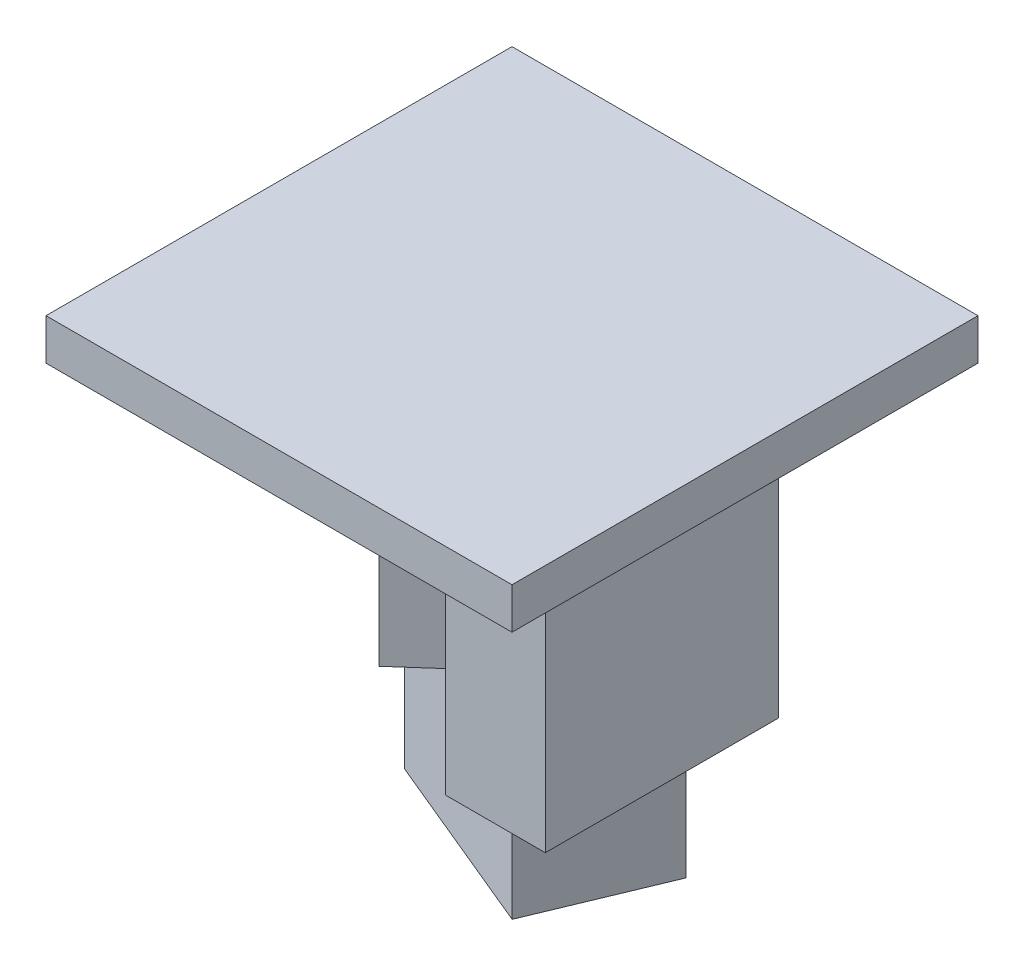
ISO-10303-21;
HEADER;
FILE_DESCRIPTION(('STEP AP214'),'2;1');
FILE_NAME('part.step','',(''),(''),'','','');
FILE_SCHEMA(('AUTOMOTIVE_DESIGN { 1 0 10303 214 1 1 1 1 }'));
ENDSEC;
DATA;
#1=APPLICATION_CONTEXT('core data for automotive mechanical design processes');
#2=APPLICATION_PROTOCOL_DEFINITION('international standard','automotive_design',2000,#1);
#3=PRODUCT_CONTEXT('',#1,'mechanical');
#4=PRODUCT('Part','Part','',(#3));
#5=PRODUCT_RELATED_PRODUCT_CATEGORY('part','',(#4));
#6=PRODUCT_DEFINITION_FORMATION('','',#4);
#7=PRODUCT_DEFINITION_CONTEXT('part definition',#1,'design');
#8=PRODUCT_DEFINITION('design','',#6,#7);
#9=PRODUCT_DEFINITION_SHAPE('','',#8);
#10=(LENGTH_UNIT() NAMED_UNIT(*) SI_UNIT(.MILLI.,.METRE.));
#11=(NAMED_UNIT(*) PLANE_ANGLE_UNIT() SI_UNIT($,.RADIAN.));
#12=(NAMED_UNIT(*) SI_UNIT($,.STERADIAN.) SOLID_ANGLE_UNIT());
#13=UNCERTAINTY_MEASURE_WITH_UNIT(LENGTH_MEASURE(1.E-05),#10,'distance_accuracy_value','');
#14=(GEOMETRIC_REPRESENTATION_CONTEXT(3) GLOBAL_UNCERTAINTY_ASSIGNED_CONTEXT((#13)) GLOBAL_UNIT_ASSIGNED_CONTEXT((#10,
#11,#12)) REPRESENTATION_CONTEXT('',''));
#15=CARTESIAN_POINT('',(0.,0.,0.));
#16=DIRECTION('',(0.,0.,1.));
#17=DIRECTION('',(1.,0.,0.));
#18=AXIS2_PLACEMENT_3D('',#15,#16,#17);
#19=CARTESIAN_POINT('',(0.,-107.6,0.));
#20=DIRECTION('',(0.,1.,0.));
#21=DIRECTION('',(0.,0.,1.));
#22=AXIS2_PLACEMENT_3D('',#19,#20,#21);
#23=PLANE('',#22);
#24=DIRECTION('',(0.383702240357465,0.,-0.923456869997003));
#25=VECTOR('',#24,1.);
#26=CARTESIAN_POINT('',(-44.9674134937716,-107.6,-3.88839100415224));
#27=LINE('',#26,#25);
#28=CARTESIAN_POINT('',(-44.9674134937716,-107.6,-3.88839100415224));
#29=VERTEX_POINT('',#28);
#30=CARTESIAN_POINT('',(-25.4753396836124,-107.6,-50.8));
#31=VERTEX_POINT('',#30);
#32=EDGE_CURVE('E186',#29,#31,#27,.T.);
#33=ORIENTED_EDGE('',*,*,#32,.F.);
#34=DIRECTION('',(-0.923456869997003,0.,-0.383702240357465));
#35=VECTOR('',#34,1.);
#36=CARTESIAN_POINT('',(25.4,-107.6,25.3497197110866));
#37=LINE('',#36,#35);
#38=CARTESIAN_POINT('',(-15.5961921600757,-107.6,8.31553945966104));
#39=VERTEX_POINT('',#38);
#40=EDGE_CURVE('E61',#39,#29,#37,.T.);
#41=ORIENTED_EDGE('',*,*,#40,.F.);
#42=DIRECTION('',(-0.748516935361959,0.,0.663115674280393));
#43=VECTOR('',#42,1.);
#44=CARTESIAN_POINT('',(-29.813723746556,-107.6,20.9109365698315));
#45=LINE('',#44,#43);
#46=CARTESIAN_POINT('',(-29.813723746556,-107.6,20.9109365698315));
#47=VERTEX_POINT('',#46);
#48=EDGE_CURVE('E247',#39,#47,#45,.T.);
#49=ORIENTED_EDGE('',*,*,#48,.T.);
#50=DIRECTION('',(-0.663115674280393,0.,-0.748516935361959));
#51=VECTOR('',#50,1.);
#52=CARTESIAN_POINT('',(-63.5,-107.6,-17.113723746556));
#53=LINE('',#52,#51);
#54=CARTESIAN_POINT('',(-63.5,-107.6,-17.113723746556));
#55=VERTEX_POINT('',#54);
#56=EDGE_CURVE('E253',#47,#55,#53,.T.);
#57=ORIENTED_EDGE('',*,*,#56,.T.);
#58=DIRECTION('',(0.748516935361959,0.,-0.663115674280393));
#59=VECTOR('',#58,1.);
#60=CARTESIAN_POINT('',(-25.4753396836124,-107.6,-50.8));
#61=LINE('',#60,#59);
#62=EDGE_CURVE('E256',#55,#31,#61,.T.);
#63=ORIENTED_EDGE('',*,*,#62,.T.);
#64=EDGE_LOOP('',(#33,#41,#49,#57,#63));
#65=FACE_BOUND('',#64,.T.);
#66=ADVANCED_FACE('F43',(#65),#23,.F.);
#67=CARTESIAN_POINT('',(0.,-3.,0.));
#68=DIRECTION('',(0.,1.,0.));
#69=DIRECTION('',(0.,0.,1.));
#70=AXIS2_PLACEMENT_3D('',#67,#68,#69);
#71=PLANE('',#70);
#72=DIRECTION('',(0.663115674280393,0.,0.748516935361959));
#73=VECTOR('',#72,1.);
#74=CARTESIAN_POINT('',(8.21093656983153,-3.,-12.7753396836125));
#75=LINE('',#74,#73);
#76=CARTESIAN_POINT('',(-25.4753396836124,-3.,-50.8));
#77=VERTEX_POINT('',#76);
#78=CARTESIAN_POINT('',(8.21093656983153,-3.,-12.7753396836125));
#79=VERTEX_POINT('',#78);
#80=EDGE_CURVE('E228',#77,#79,#75,.T.);
#81=ORIENTED_EDGE('',*,*,#80,.F.);
#82=DIRECTION('',(0.748516935361959,0.,-0.663115674280393));
#83=VECTOR('',#82,1.);
#84=CARTESIAN_POINT('',(-25.4753396836124,-3.,-50.8));
#85=LINE('',#84,#83);
#86=CARTESIAN_POINT('',(-63.5,-3.,-17.113723746556));
#87=VERTEX_POINT('',#86);
#88=EDGE_CURVE('E248',#87,#77,#85,.T.);
#89=ORIENTED_EDGE('',*,*,#88,.F.);
#90=DIRECTION('',(-0.663115674280393,0.,-0.748516935361959));
#91=VECTOR('',#90,1.);
#92=CARTESIAN_POINT('',(-63.5,-3.,-17.113723746556));
#93=LINE('',#92,#91);
#94=CARTESIAN_POINT('',(-29.813723746556,-3.,20.9109365698315));
#95=VERTEX_POINT('',#94);
#96=EDGE_CURVE('E267',#95,#87,#93,.T.);
#97=ORIENTED_EDGE('',*,*,#96,.F.);
#98=DIRECTION('',(-0.748516935361959,0.,0.663115674280393));
#99=VECTOR('',#98,1.);
#100=CARTESIAN_POINT('',(-29.813723746556,-3.,20.9109365698315));
#101=LINE('',#100,#99);
#102=EDGE_CURVE('E263',#79,#95,#101,.T.);
#103=ORIENTED_EDGE('',*,*,#102,.F.);
#104=EDGE_LOOP('',(#81,#89,#97,#103));
#105=FACE_BOUND('',#104,.T.);
#106=DIRECTION('',(0.,0.,1.));
#107=VECTOR('',#106,1.);
#108=CARTESIAN_POINT('',(-88.9,-3.,-88.9));
#109=LINE('',#108,#107);
#110=CARTESIAN_POINT('',(-88.9,-3.,-88.9));
#111=VERTEX_POINT('',#110);
#112=CARTESIAN_POINT('',(-88.9,-3.,88.9));
#113=VERTEX_POINT('',#112);
#114=EDGE_CURVE('E289',#111,#113,#109,.T.);
#115=ORIENTED_EDGE('',*,*,#114,.F.);
#116=DIRECTION('',(-1.,0.,0.));
#117=VECTOR('',#116,1.);
#118=CARTESIAN_POINT('',(-88.9,-3.,-88.9));
#119=LINE('',#118,#117);
#120=CARTESIAN_POINT('',(88.9,-3.,-88.9));
#121=VERTEX_POINT('',#120);
#122=EDGE_CURVE('E301',#121,#111,#119,.T.);
#123=ORIENTED_EDGE('',*,*,#122,.F.);
#124=DIRECTION('',(0.,0.,-1.));
#125=VECTOR('',#124,1.);
#126=CARTESIAN_POINT('',(88.9,-3.,-88.9));
#127=LINE('',#126,#125);
#128=CARTESIAN_POINT('',(88.9,-3.,88.9));
#129=VERTEX_POINT('',#128);
#130=EDGE_CURVE('E297',#129,#121,#127,.T.);
#131=ORIENTED_EDGE('',*,*,#130,.F.);
#132=DIRECTION('',(1.,0.,0.));
#133=VECTOR('',#132,1.);
#134=CARTESIAN_POINT('',(-88.9,-3.,88.9));
#135=LINE('',#134,#133);
#136=EDGE_CURVE('E293',#113,#129,#135,.T.);
#137=ORIENTED_EDGE('',*,*,#136,.F.);
#138=EDGE_LOOP('',(#115,#123,#131,#137));
#139=FACE_BOUND('',#138,.T.);
#140=DIRECTION('',(0.,0.,1.));
#141=VECTOR('',#140,1.);
#142=CARTESIAN_POINT('',(63.5,-3.,-38.1));
#143=LINE('',#142,#141);
#144=CARTESIAN_POINT('',(63.5,-3.,-38.1));
#145=VERTEX_POINT('',#144);
#146=CARTESIAN_POINT('',(63.5,-3.,50.8));
#147=VERTEX_POINT('',#146);
#148=EDGE_CURVE('E224',#145,#147,#143,.T.);
#149=ORIENTED_EDGE('',*,*,#148,.F.);
#150=DIRECTION('',(1.,0.,0.));
#151=VECTOR('',#150,1.);
#152=CARTESIAN_POINT('',(63.5,-3.,-38.1));
#153=LINE('',#152,#151);
#154=CARTESIAN_POINT('',(25.4,-3.,-38.1));
#155=VERTEX_POINT('',#154);
#156=EDGE_CURVE('E211',#155,#145,#153,.T.);
#157=ORIENTED_EDGE('',*,*,#156,.F.);
#158=DIRECTION('',(0.,0.,-1.));
#159=VECTOR('',#158,1.);
#160=CARTESIAN_POINT('',(25.4,-3.,-38.1));
#161=LINE('',#160,#159);
#162=CARTESIAN_POINT('',(25.4,-3.,50.8));
#163=VERTEX_POINT('',#162);
#164=EDGE_CURVE('E215',#163,#155,#161,.T.);
#165=ORIENTED_EDGE('',*,*,#164,.F.);
#166=DIRECTION('',(-1.,0.,0.));
#167=VECTOR('',#166,1.);
#168=CARTESIAN_POINT('',(63.5,-3.,50.8));
#169=LINE('',#168,#167);
#170=EDGE_CURVE('E220',#147,#163,#169,.T.);
#171=ORIENTED_EDGE('',*,*,#170,.F.);
#172=EDGE_LOOP('',(#149,#157,#165,#171));
#173=FACE_BOUND('',#172,.T.);
#174=ADVANCED_FACE('F338',(#105,#139,#173),#71,.F.);
#175=CARTESIAN_POINT('',(-88.9,12.7,-88.9));
#176=DIRECTION('',(1.,0.,0.));
#177=DIRECTION('',(0.,0.,-1.));
#178=AXIS2_PLACEMENT_3D('',#175,#176,#177);
#179=PLANE('',#178);
#180=DIRECTION('',(0.,-1.,0.));
#181=VECTOR('',#180,1.);
#182=CARTESIAN_POINT('',(-88.9,12.7,-88.9));
#183=LINE('',#182,#181);
#184=CARTESIAN_POINT('',(-88.9,12.7,-88.9));
#185=VERTEX_POINT('',#184);
#186=EDGE_CURVE('E318',#185,#111,#183,.T.);
#187=ORIENTED_EDGE('',*,*,#186,.T.);
#188=ORIENTED_EDGE('',*,*,#114,.T.);
#189=DIRECTION('',(0.,-1.,0.));
#190=VECTOR('',#189,1.);
#191=CARTESIAN_POINT('',(-88.9,12.7,88.9));
#192=LINE('',#191,#190);
#193=CARTESIAN_POINT('',(-88.9,12.7,88.9));
#194=VERTEX_POINT('',#193);
#195=EDGE_CURVE('E47',#194,#113,#192,.T.);
#196=ORIENTED_EDGE('',*,*,#195,.F.);
#197=DIRECTION('',(0.,0.,1.));
#198=VECTOR('',#197,1.);
#199=CARTESIAN_POINT('',(-88.9,12.7,-88.9));
#200=LINE('',#199,#198);
#201=EDGE_CURVE('E305',#185,#194,#200,.T.);
#202=ORIENTED_EDGE('',*,*,#201,.F.);
#203=EDGE_LOOP('',(#187,#188,#196,#202));
#204=FACE_BOUND('',#203,.T.);
#205=ADVANCED_FACE('F45',(#204),#179,.F.);
#206=CARTESIAN_POINT('',(-88.9,12.7,88.9));
#207=DIRECTION('',(0.,0.,-1.));
#208=DIRECTION('',(-1.,0.,0.));
#209=AXIS2_PLACEMENT_3D('',#206,#207,#208);
#210=PLANE('',#209);
#211=ORIENTED_EDGE('',*,*,#195,.T.);
#212=ORIENTED_EDGE('',*,*,#136,.T.);
#213=DIRECTION('',(0.,-1.,0.));
#214=VECTOR('',#213,1.);
#215=CARTESIAN_POINT('',(88.9,12.7,88.9));
#216=LINE('',#215,#214);
#217=CARTESIAN_POINT('',(88.9,12.7,88.9));
#218=VERTEX_POINT('',#217);
#219=EDGE_CURVE('E323',#218,#129,#216,.T.);
#220=ORIENTED_EDGE('',*,*,#219,.F.);
#221=DIRECTION('',(1.,0.,0.));
#222=VECTOR('',#221,1.);
#223=CARTESIAN_POINT('',(-88.9,12.7,88.9));
#224=LINE('',#223,#222);
#225=EDGE_CURVE('E309',#194,#218,#224,.T.);
#226=ORIENTED_EDGE('',*,*,#225,.F.);
#227=EDGE_LOOP('',(#211,#212,#220,#226));
#228=FACE_BOUND('',#227,.T.);
#229=ADVANCED_FACE('F333',(#228),#210,.F.);
#230=CARTESIAN_POINT('',(88.9,12.7,-88.9));
#231=DIRECTION('',(-1.,0.,0.));
#232=DIRECTION('',(0.,0.,1.));
#233=AXIS2_PLACEMENT_3D('',#230,#231,#232);
#234=PLANE('',#233);
#235=ORIENTED_EDGE('',*,*,#219,.T.);
#236=ORIENTED_EDGE('',*,*,#130,.T.);
#237=DIRECTION('',(0.,-1.,0.));
#238=VECTOR('',#237,1.);
#239=CARTESIAN_POINT('',(88.9,12.7,-88.9));
#240=LINE('',#239,#238);
#241=CARTESIAN_POINT('',(88.9,12.7,-88.9));
#242=VERTEX_POINT('',#241);
#243=EDGE_CURVE('E321',#242,#121,#240,.T.);
#244=ORIENTED_EDGE('',*,*,#243,.F.);
#245=DIRECTION('',(0.,0.,-1.));
#246=VECTOR('',#245,1.);
#247=CARTESIAN_POINT('',(88.9,12.7,-88.9));
#248=LINE('',#247,#246);
#249=EDGE_CURVE('E312',#218,#242,#248,.T.);
#250=ORIENTED_EDGE('',*,*,#249,.F.);
#251=EDGE_LOOP('',(#235,#236,#244,#250));
#252=FACE_BOUND('',#251,.T.);
#253=ADVANCED_FACE('F346',(#252),#234,.F.);
#254=CARTESIAN_POINT('',(-88.9,12.7,-88.9));
#255=DIRECTION('',(0.,0.,1.));
#256=DIRECTION('',(1.,0.,0.));
#257=AXIS2_PLACEMENT_3D('',#254,#255,#256);
#258=PLANE('',#257);
#259=ORIENTED_EDGE('',*,*,#243,.T.);
#260=ORIENTED_EDGE('',*,*,#122,.T.);
#261=ORIENTED_EDGE('',*,*,#186,.F.);
#262=DIRECTION('',(-1.,0.,0.));
#263=VECTOR('',#262,1.);
#264=CARTESIAN_POINT('',(-88.9,12.7,-88.9));
#265=LINE('',#264,#263);
#266=EDGE_CURVE('E315',#242,#185,#265,.T.);
#267=ORIENTED_EDGE('',*,*,#266,.F.);
#268=EDGE_LOOP('',(#259,#260,#261,#267));
#269=FACE_BOUND('',#268,.T.);
#270=ADVANCED_FACE('F344',(#269),#258,.F.);
#271=CARTESIAN_POINT('',(0.,12.7,0.));
#272=DIRECTION('',(0.,1.,0.));
#273=DIRECTION('',(0.,0.,1.));
#274=AXIS2_PLACEMENT_3D('',#271,#272,#273);
#275=PLANE('',#274);
#276=ORIENTED_EDGE('',*,*,#201,.T.);
#277=ORIENTED_EDGE('',*,*,#225,.T.);
#278=ORIENTED_EDGE('',*,*,#249,.T.);
#279=ORIENTED_EDGE('',*,*,#266,.T.);
#280=EDGE_LOOP('',(#276,#277,#278,#279));
#281=FACE_BOUND('',#280,.T.);
#282=ADVANCED_FACE('F353',(#281),#275,.T.);
#283=CARTESIAN_POINT('',(8.21093656983153,-107.6,-12.7753396836125));
#284=DIRECTION('',(-0.748516935361959,0.,0.663115674280393));
#285=DIRECTION('',(0.663115674280393,0.,0.748516935361959));
#286=AXIS2_PLACEMENT_3D('',#283,#284,#285);
#287=PLANE('',#286);
#288=ORIENTED_EDGE('',*,*,#80,.T.);
#289=DIRECTION('',(0.,1.,0.));
#290=VECTOR('',#289,1.);
#291=CARTESIAN_POINT('',(8.21093656983153,-107.6,-12.7753396836125));
#292=LINE('',#291,#290);
#293=CARTESIAN_POINT('',(8.21093656983153,-107.6,-12.7753396836125));
#294=VERTEX_POINT('',#293);
#295=EDGE_CURVE('E285',#294,#79,#292,.T.);
#296=ORIENTED_EDGE('',*,*,#295,.F.);
#297=DIRECTION('',(0.663115674280393,0.,0.748516935361959));
#298=VECTOR('',#297,1.);
#299=CARTESIAN_POINT('',(8.21093656983153,-107.6,-12.7753396836125));
#300=LINE('',#299,#298);
#301=EDGE_CURVE('E243',#31,#294,#300,.T.);
#302=ORIENTED_EDGE('',*,*,#301,.F.);
#303=DIRECTION('',(0.,1.,0.));
#304=VECTOR('',#303,1.);
#305=CARTESIAN_POINT('',(-25.4753396836124,-107.6,-50.8));
#306=LINE('',#305,#304);
#307=EDGE_CURVE('E259',#31,#77,#306,.T.);
#308=ORIENTED_EDGE('',*,*,#307,.T.);
#309=EDGE_LOOP('',(#288,#296,#302,#308));
#310=FACE_BOUND('',#309,.T.);
#311=ADVANCED_FACE('F378',(#310),#287,.F.);
#312=CARTESIAN_POINT('',(-29.813723746556,-107.6,20.9109365698315));
#313=DIRECTION('',(-0.663115674280393,0.,-0.748516935361959));
#314=DIRECTION('',(-0.748516935361959,0.,0.663115674280393));
#315=AXIS2_PLACEMENT_3D('',#312,#313,#314);
#316=PLANE('',#315);
#317=ORIENTED_EDGE('',*,*,#102,.T.);
#318=DIRECTION('',(0.,1.,0.));
#319=VECTOR('',#318,1.);
#320=CARTESIAN_POINT('',(-29.813723746556,-107.6,20.9109365698315));
#321=LINE('',#320,#319);
#322=EDGE_CURVE('E281',#47,#95,#321,.T.);
#323=ORIENTED_EDGE('',*,*,#322,.F.);
#324=ORIENTED_EDGE('',*,*,#48,.F.);
#325=EDGE_CURVE('E249',#294,#39,#45,.T.);
#326=ORIENTED_EDGE('',*,*,#325,.F.);
#327=ORIENTED_EDGE('',*,*,#295,.T.);
#328=EDGE_LOOP('',(#317,#323,#324,#326,#327));
#329=FACE_BOUND('',#328,.T.);
#330=ADVANCED_FACE('F374',(#329),#316,.F.);
#331=CARTESIAN_POINT('',(-63.5,-107.6,-17.113723746556));
#332=DIRECTION('',(0.748516935361959,0.,-0.663115674280393));
#333=DIRECTION('',(-0.663115674280393,0.,-0.748516935361959));
#334=AXIS2_PLACEMENT_3D('',#331,#332,#333);
#335=PLANE('',#334);
#336=ORIENTED_EDGE('',*,*,#96,.T.);
#337=DIRECTION('',(0.,1.,0.));
#338=VECTOR('',#337,1.);
#339=CARTESIAN_POINT('',(-63.5,-107.6,-17.113723746556));
#340=LINE('',#339,#338);
#341=EDGE_CURVE('E277',#55,#87,#340,.T.);
#342=ORIENTED_EDGE('',*,*,#341,.F.);
#343=ORIENTED_EDGE('',*,*,#56,.F.);
#344=ORIENTED_EDGE('',*,*,#322,.T.);
#345=EDGE_LOOP('',(#336,#342,#343,#344));
#346=FACE_BOUND('',#345,.T.);
#347=ADVANCED_FACE('F370',(#346),#335,.F.);
#348=CARTESIAN_POINT('',(-25.4753396836124,-107.6,-50.8));
#349=DIRECTION('',(0.663115674280393,0.,0.748516935361959));
#350=DIRECTION('',(0.748516935361959,0.,-0.663115674280393));
#351=AXIS2_PLACEMENT_3D('',#348,#349,#350);
#352=PLANE('',#351);
#353=ORIENTED_EDGE('',*,*,#88,.T.);
#354=ORIENTED_EDGE('',*,*,#307,.F.);
#355=ORIENTED_EDGE('',*,*,#62,.F.);
#356=ORIENTED_EDGE('',*,*,#341,.T.);
#357=EDGE_LOOP('',(#353,#354,#355,#356));
#358=FACE_BOUND('',#357,.T.);
#359=ADVANCED_FACE('F366',(#358),#352,.F.);
#360=CARTESIAN_POINT('',(63.5,-107.6,-38.1));
#361=DIRECTION('',(-1.,0.,0.));
#362=DIRECTION('',(0.,0.,1.));
#363=AXIS2_PLACEMENT_3D('',#360,#361,#362);
#364=PLANE('',#363);
#365=ORIENTED_EDGE('',*,*,#148,.T.);
#366=DIRECTION('',(0.,1.,0.));
#367=VECTOR('',#366,1.);
#368=CARTESIAN_POINT('',(63.5,-107.6,50.8));
#369=LINE('',#368,#367);
#370=CARTESIAN_POINT('',(63.5,-107.6,50.8));
#371=VERTEX_POINT('',#370);
#372=EDGE_CURVE('E188',#371,#147,#369,.T.);
#373=ORIENTED_EDGE('',*,*,#372,.F.);
#374=DIRECTION('',(0.,0.,1.));
#375=VECTOR('',#374,1.);
#376=CARTESIAN_POINT('',(63.5,-107.6,-38.1));
#377=LINE('',#376,#375);
#378=CARTESIAN_POINT('',(63.5,-107.6,-38.1));
#379=VERTEX_POINT('',#378);
#380=EDGE_CURVE('E216',#379,#371,#377,.T.);
#381=ORIENTED_EDGE('',*,*,#380,.F.);
#382=DIRECTION('',(0.,1.,0.));
#383=VECTOR('',#382,1.);
#384=CARTESIAN_POINT('',(63.5,-107.6,-38.1));
#385=LINE('',#384,#383);
#386=EDGE_CURVE('E206',#379,#145,#385,.T.);
#387=ORIENTED_EDGE('',*,*,#386,.T.);
#388=EDGE_LOOP('',(#365,#373,#381,#387));
#389=FACE_BOUND('',#388,.T.);
#390=ADVANCED_FACE('F369',(#389),#364,.F.);
#391=CARTESIAN_POINT('',(63.5,-107.6,50.8));
#392=DIRECTION('',(0.,0.,-1.));
#393=DIRECTION('',(-1.,0.,0.));
#394=AXIS2_PLACEMENT_3D('',#391,#392,#393);
#395=PLANE('',#394);
#396=ORIENTED_EDGE('',*,*,#170,.T.);
#397=DIRECTION('',(0.,1.,0.));
#398=VECTOR('',#397,1.);
#399=CARTESIAN_POINT('',(25.4,-107.6,50.8));
#400=LINE('',#399,#398);
#401=CARTESIAN_POINT('',(25.4,-107.6,50.8));
#402=VERTEX_POINT('',#401);
#403=EDGE_CURVE('E193',#402,#163,#400,.T.);
#404=ORIENTED_EDGE('',*,*,#403,.F.);
#405=DIRECTION('',(-1.,0.,0.));
#406=VECTOR('',#405,1.);
#407=CARTESIAN_POINT('',(63.5,-107.6,50.8));
#408=LINE('',#407,#406);
#409=EDGE_CURVE('E236',#371,#402,#408,.T.);
#410=ORIENTED_EDGE('',*,*,#409,.F.);
#411=ORIENTED_EDGE('',*,*,#372,.T.);
#412=EDGE_LOOP('',(#396,#404,#410,#411));
#413=FACE_BOUND('',#412,.T.);
#414=ADVANCED_FACE('F414',(#413),#395,.F.);
#415=CARTESIAN_POINT('',(25.4,-107.6,-38.1));
#416=DIRECTION('',(1.,0.,0.));
#417=DIRECTION('',(0.,0.,-1.));
#418=AXIS2_PLACEMENT_3D('',#415,#416,#417);
#419=PLANE('',#418);
#420=ORIENTED_EDGE('',*,*,#164,.T.);
#421=DIRECTION('',(0.,1.,0.));
#422=VECTOR('',#421,1.);
#423=CARTESIAN_POINT('',(25.4,-107.6,-38.1));
#424=LINE('',#423,#422);
#425=CARTESIAN_POINT('',(25.4,-107.6,-38.1));
#426=VERTEX_POINT('',#425);
#427=EDGE_CURVE('E202',#426,#155,#424,.T.);
#428=ORIENTED_EDGE('',*,*,#427,.F.);
#429=DIRECTION('',(0.,0.,-1.));
#430=VECTOR('',#429,1.);
#431=CARTESIAN_POINT('',(25.4,-107.6,-38.1));
#432=LINE('',#431,#430);
#433=CARTESIAN_POINT('',(25.4,-107.6,-29.6609707179801));
#434=VERTEX_POINT('',#433);
#435=EDGE_CURVE('E231',#434,#426,#432,.T.);
#436=ORIENTED_EDGE('',*,*,#435,.F.);
#437=CARTESIAN_POINT('',(25.4,-107.6,25.3497197110866));
#438=VERTEX_POINT('',#437);
#439=EDGE_CURVE('E237',#438,#434,#432,.T.);
#440=ORIENTED_EDGE('',*,*,#439,.F.);
#441=EDGE_CURVE('E232',#402,#438,#432,.T.);
#442=ORIENTED_EDGE('',*,*,#441,.F.);
#443=ORIENTED_EDGE('',*,*,#403,.T.);
#444=EDGE_LOOP('',(#420,#428,#436,#440,#442,#443));
#445=FACE_BOUND('',#444,.T.);
#446=ADVANCED_FACE('F422',(#445),#419,.F.);
#447=CARTESIAN_POINT('',(63.5,-107.6,-38.1));
#448=DIRECTION('',(0.,0.,1.));
#449=DIRECTION('',(1.,0.,0.));
#450=AXIS2_PLACEMENT_3D('',#447,#448,#449);
#451=PLANE('',#450);
#452=ORIENTED_EDGE('',*,*,#156,.T.);
#453=ORIENTED_EDGE('',*,*,#386,.F.);
#454=DIRECTION('',(1.,0.,0.));
#455=VECTOR('',#454,1.);
#456=CARTESIAN_POINT('',(63.5,-107.6,-38.1));
#457=LINE('',#456,#455);
#458=EDGE_CURVE('E210',#426,#379,#457,.T.);
#459=ORIENTED_EDGE('',*,*,#458,.F.);
#460=ORIENTED_EDGE('',*,*,#427,.T.);
#461=EDGE_LOOP('',(#452,#453,#459,#460));
#462=FACE_BOUND('',#461,.T.);
#463=ADVANCED_FACE('F430',(#462),#451,.F.);
#464=CARTESIAN_POINT('',(0.,-107.6,0.));
#465=DIRECTION('',(0.,-1.,0.));
#466=DIRECTION('',(0.,0.,-1.));
#467=AXIS2_PLACEMENT_3D('',#464,#465,#466);
#468=PLANE('',#467);
#469=DIRECTION('',(-0.383702240357465,0.,0.923456869997003));
#470=VECTOR('',#469,1.);
#471=CARTESIAN_POINT('',(44.8920738101592,-107.6,-21.5618892847612));
#472=LINE('',#471,#470);
#473=CARTESIAN_POINT('',(44.8920738101592,-107.6,-21.5618892847612));
#474=VERTEX_POINT('',#473);
#475=EDGE_CURVE('E611',#474,#438,#472,.T.);
#476=ORIENTED_EDGE('',*,*,#475,.F.);
#477=DIRECTION('',(0.923456869997003,0.,0.383702240357465));
#478=VECTOR('',#477,1.);
#479=CARTESIAN_POINT('',(-25.4753396836124,-107.6,-50.8));
#480=LINE('',#479,#478);
#481=EDGE_CURVE('E11',#434,#474,#480,.T.);
#482=ORIENTED_EDGE('',*,*,#481,.F.);
#483=ORIENTED_EDGE('',*,*,#435,.T.);
#484=ORIENTED_EDGE('',*,*,#458,.T.);
#485=ORIENTED_EDGE('',*,*,#380,.T.);
#486=ORIENTED_EDGE('',*,*,#409,.T.);
#487=ORIENTED_EDGE('',*,*,#441,.T.);
#488=EDGE_LOOP('',(#476,#482,#483,#484,#485,#486,#487));
#489=FACE_BOUND('',#488,.T.);
#490=ADVANCED_FACE('F364',(#489),#468,.T.);
#491=CARTESIAN_POINT('',(0.,-107.6,0.));
#492=DIRECTION('',(0.,-1.,0.));
#493=DIRECTION('',(0.,0.,-1.));
#494=AXIS2_PLACEMENT_3D('',#491,#492,#493);
#495=PLANE('',#494);
#496=EDGE_CURVE('E54',#31,#434,#480,.T.);
#497=ORIENTED_EDGE('',*,*,#496,.F.);
#498=ORIENTED_EDGE('',*,*,#301,.T.);
#499=ORIENTED_EDGE('',*,*,#325,.T.);
#500=EDGE_CURVE('E183',#438,#39,#37,.T.);
#501=ORIENTED_EDGE('',*,*,#500,.F.);
#502=ORIENTED_EDGE('',*,*,#439,.T.);
#503=EDGE_LOOP('',(#497,#498,#499,#501,#502));
#504=FACE_BOUND('',#503,.T.);
#505=ADVANCED_FACE('F443',(#504),#495,.F.);
#506=CARTESIAN_POINT('',(-44.9674134937716,-161.4,-3.88839100415224));
#507=DIRECTION('',(0.923456869997003,0.,0.383702240357465));
#508=DIRECTION('',(0.383702240357465,0.,-0.923456869997003));
#509=AXIS2_PLACEMENT_3D('',#506,#507,#508);
#510=PLANE('',#509);
#511=ORIENTED_EDGE('',*,*,#32,.T.);
#512=DIRECTION('',(0.,1.,0.));
#513=VECTOR('',#512,1.);
#514=CARTESIAN_POINT('',(-25.4753396836124,-161.4,-50.8));
#515=LINE('',#514,#513);
#516=CARTESIAN_POINT('',(-25.4753396836124,-161.4,-50.8));
#517=VERTEX_POINT('',#516);
#518=EDGE_CURVE('E165',#517,#31,#515,.T.);
#519=ORIENTED_EDGE('',*,*,#518,.F.);
#520=DIRECTION('',(0.383702240357465,0.,-0.923456869997003));
#521=VECTOR('',#520,1.);
#522=CARTESIAN_POINT('',(-44.9674134937716,-161.4,-3.88839100415224));
#523=LINE('',#522,#521);
#524=CARTESIAN_POINT('',(-44.9674134937716,-161.4,-3.88839100415224));
#525=VERTEX_POINT('',#524);
#526=EDGE_CURVE('E173',#525,#517,#523,.T.);
#527=ORIENTED_EDGE('',*,*,#526,.F.);
#528=DIRECTION('',(0.,1.,0.));
#529=VECTOR('',#528,1.);
#530=CARTESIAN_POINT('',(-44.9674134937716,-161.4,-3.88839100415224));
#531=LINE('',#530,#529);
#532=EDGE_CURVE('E614',#525,#29,#531,.T.);
#533=ORIENTED_EDGE('',*,*,#532,.T.);
#534=EDGE_LOOP('',(#511,#519,#527,#533));
#535=FACE_BOUND('',#534,.T.);
#536=ADVANCED_FACE('F185',(#535),#510,.F.);
#537=CARTESIAN_POINT('',(-25.4753396836124,-161.4,-50.8));
#538=DIRECTION('',(-0.383702240357465,0.,0.923456869997003));
#539=DIRECTION('',(0.923456869997003,0.,0.383702240357465));
#540=AXIS2_PLACEMENT_3D('',#537,#538,#539);
#541=PLANE('',#540);
#542=ORIENTED_EDGE('',*,*,#496,.T.);
#543=ORIENTED_EDGE('',*,*,#481,.T.);
#544=DIRECTION('',(0.,1.,0.));
#545=VECTOR('',#544,1.);
#546=CARTESIAN_POINT('',(44.8920738101592,-161.4,-21.5618892847612));
#547=LINE('',#546,#545);
#548=CARTESIAN_POINT('',(44.8920738101592,-161.4,-21.5618892847612));
#549=VERTEX_POINT('',#548);
#550=EDGE_CURVE('E168',#549,#474,#547,.T.);
#551=ORIENTED_EDGE('',*,*,#550,.F.);
#552=DIRECTION('',(0.923456869997003,0.,0.383702240357465));
#553=VECTOR('',#552,1.);
#554=CARTESIAN_POINT('',(-25.4753396836124,-161.4,-50.8));
#555=LINE('',#554,#553);
#556=EDGE_CURVE('E160',#517,#549,#555,.T.);
#557=ORIENTED_EDGE('',*,*,#556,.F.);
#558=ORIENTED_EDGE('',*,*,#518,.T.);
#559=EDGE_LOOP('',(#542,#543,#551,#557,#558));
#560=FACE_BOUND('',#559,.T.);
#561=ADVANCED_FACE('F163',(#560),#541,.F.);
#562=CARTESIAN_POINT('',(44.8920738101592,-161.4,-21.5618892847612));
#563=DIRECTION('',(-0.923456869997003,0.,-0.383702240357465));
#564=DIRECTION('',(-0.383702240357465,0.,0.923456869997003));
#565=AXIS2_PLACEMENT_3D('',#562,#563,#564);
#566=PLANE('',#565);
#567=ORIENTED_EDGE('',*,*,#475,.T.);
#568=DIRECTION('',(0.,1.,0.));
#569=VECTOR('',#568,1.);
#570=CARTESIAN_POINT('',(25.4,-161.4,25.3497197110866));
#571=LINE('',#570,#569);
#572=CARTESIAN_POINT('',(25.4,-161.4,25.3497197110866));
#573=VERTEX_POINT('',#572);
#574=EDGE_CURVE('E195',#573,#438,#571,.T.);
#575=ORIENTED_EDGE('',*,*,#574,.F.);
#576=DIRECTION('',(-0.383702240357465,0.,0.923456869997003));
#577=VECTOR('',#576,1.);
#578=CARTESIAN_POINT('',(44.8920738101592,-161.4,-21.5618892847612));
#579=LINE('',#578,#577);
#580=EDGE_CURVE('E172',#549,#573,#579,.T.);
#581=ORIENTED_EDGE('',*,*,#580,.F.);
#582=ORIENTED_EDGE('',*,*,#550,.T.);
#583=EDGE_LOOP('',(#567,#575,#581,#582));
#584=FACE_BOUND('',#583,.T.);
#585=ADVANCED_FACE('F462',(#584),#566,.F.);
#586=CARTESIAN_POINT('',(25.4,-161.4,25.3497197110866));
#587=DIRECTION('',(0.383702240357465,0.,-0.923456869997003));
#588=DIRECTION('',(-0.923456869997003,0.,-0.383702240357465));
#589=AXIS2_PLACEMENT_3D('',#586,#587,#588);
#590=PLANE('',#589);
#591=ORIENTED_EDGE('',*,*,#500,.T.);
#592=ORIENTED_EDGE('',*,*,#40,.T.);
#593=ORIENTED_EDGE('',*,*,#532,.F.);
#594=DIRECTION('',(-0.923456869997003,0.,-0.383702240357465));
#595=VECTOR('',#594,1.);
#596=CARTESIAN_POINT('',(25.4,-161.4,25.3497197110866));
#597=LINE('',#596,#595);
#598=EDGE_CURVE('E178',#573,#525,#597,.T.);
#599=ORIENTED_EDGE('',*,*,#598,.F.);
#600=ORIENTED_EDGE('',*,*,#574,.T.);
#601=EDGE_LOOP('',(#591,#592,#593,#599,#600));
#602=FACE_BOUND('',#601,.T.);
#603=ADVANCED_FACE('F469',(#602),#590,.F.);
#604=CARTESIAN_POINT('',(0.,-161.4,0.));
#605=DIRECTION('',(0.,-1.,0.));
#606=DIRECTION('',(0.,0.,-1.));
#607=AXIS2_PLACEMENT_3D('',#604,#605,#606);
#608=PLANE('',#607);
#609=ORIENTED_EDGE('',*,*,#526,.T.);
#610=ORIENTED_EDGE('',*,*,#556,.T.);
#611=ORIENTED_EDGE('',*,*,#580,.T.);
#612=ORIENTED_EDGE('',*,*,#598,.T.);
#613=EDGE_LOOP('',(#609,#610,#611,#612));
#614=FACE_BOUND('',#613,.T.);
#615=ADVANCED_FACE('F176',(#614),#608,.T.);
#616=CLOSED_SHELL('',(#66,#174,#205,#229,#253,#270,#282,#311,#330,#347,#359,#390,#414,#446,#463,
#490,#505,#536,#561,#585,#603,#615));
#617=MANIFOLD_SOLID_BREP('B2',#616);
#618=ADVANCED_BREP_SHAPE_REPRESENTATION('',(#18,#617),#14);
#619=SHAPE_DEFINITION_REPRESENTATION(#9,#618);
ENDSEC;
END-ISO-10303-21;
